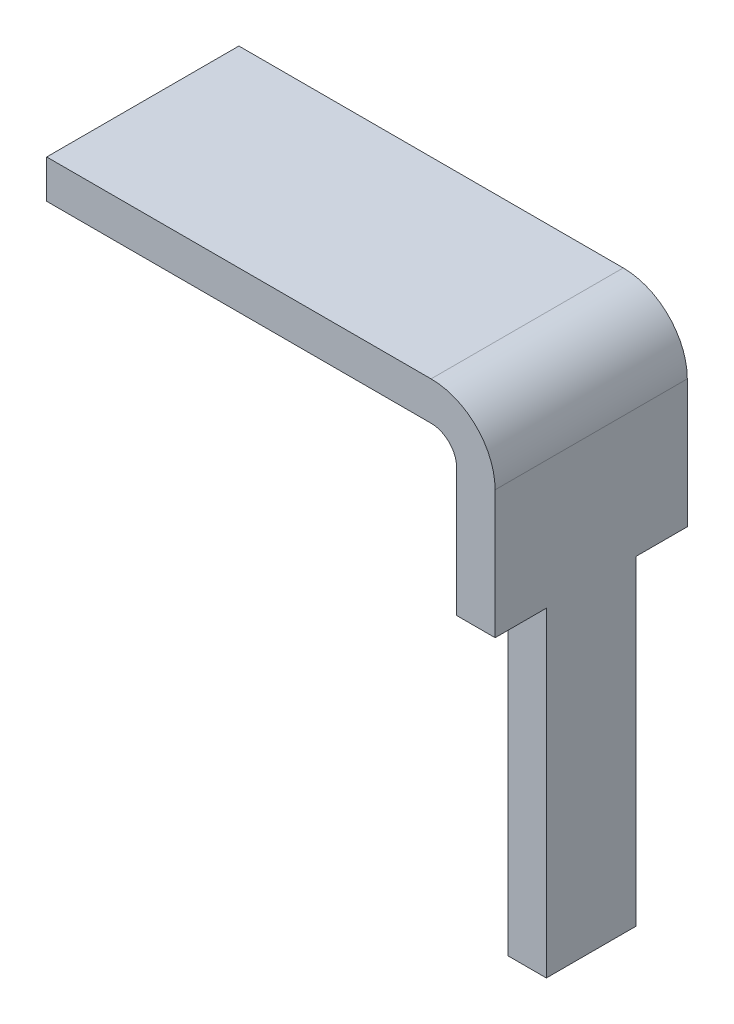
ISO-10303-21;
HEADER;
FILE_DESCRIPTION(('STEP AP214'),'2;1');
FILE_NAME('part.step','',(''),(''),'','','');
FILE_SCHEMA(('AUTOMOTIVE_DESIGN { 1 0 10303 214 1 1 1 1 }'));
ENDSEC;
DATA;
#1=APPLICATION_CONTEXT('core data for automotive mechanical design processes');
#2=APPLICATION_PROTOCOL_DEFINITION('international standard','automotive_design',2000,#1);
#3=PRODUCT_CONTEXT('',#1,'mechanical');
#4=PRODUCT('Part','Part','',(#3));
#5=PRODUCT_RELATED_PRODUCT_CATEGORY('part','',(#4));
#6=PRODUCT_DEFINITION_FORMATION('','',#4);
#7=PRODUCT_DEFINITION_CONTEXT('part definition',#1,'design');
#8=PRODUCT_DEFINITION('design','',#6,#7);
#9=PRODUCT_DEFINITION_SHAPE('','',#8);
#10=(LENGTH_UNIT() NAMED_UNIT(*) SI_UNIT(.MILLI.,.METRE.));
#11=(NAMED_UNIT(*) PLANE_ANGLE_UNIT() SI_UNIT($,.RADIAN.));
#12=(NAMED_UNIT(*) SI_UNIT($,.STERADIAN.) SOLID_ANGLE_UNIT());
#13=UNCERTAINTY_MEASURE_WITH_UNIT(LENGTH_MEASURE(1.E-05),#10,'distance_accuracy_value','');
#14=(GEOMETRIC_REPRESENTATION_CONTEXT(3) GLOBAL_UNCERTAINTY_ASSIGNED_CONTEXT((#13)) GLOBAL_UNIT_ASSIGNED_CONTEXT((#10,
#11,#12)) REPRESENTATION_CONTEXT('',''));
#15=CARTESIAN_POINT('',(0.,0.,0.));
#16=DIRECTION('',(0.,0.,1.));
#17=DIRECTION('',(1.,0.,0.));
#18=AXIS2_PLACEMENT_3D('',#15,#16,#17);
#19=CARTESIAN_POINT('',(0.,0.,1.5));
#20=DIRECTION('',(1.,0.,0.));
#21=DIRECTION('',(0.,0.,-1.));
#22=AXIS2_PLACEMENT_3D('',#19,#20,#21);
#23=PLANE('',#22);
#24=DIRECTION('',(0.,-1.,0.));
#25=VECTOR('',#24,1.);
#26=CARTESIAN_POINT('',(0.,0.,0.));
#27=LINE('',#26,#25);
#28=CARTESIAN_POINT('',(0.,0.,0.));
#29=VERTEX_POINT('',#28);
#30=CARTESIAN_POINT('',(0.,-0.3,0.));
#31=VERTEX_POINT('',#30);
#32=EDGE_CURVE('E210',#29,#31,#27,.T.);
#33=ORIENTED_EDGE('',*,*,#32,.T.);
#34=DIRECTION('',(0.,0.,-1.));
#35=VECTOR('',#34,1.);
#36=CARTESIAN_POINT('',(0.,-0.3,1.5));
#37=LINE('',#36,#35);
#38=CARTESIAN_POINT('',(0.,-0.3,1.5));
#39=VERTEX_POINT('',#38);
#40=EDGE_CURVE('E170',#39,#31,#37,.T.);
#41=ORIENTED_EDGE('',*,*,#40,.F.);
#42=DIRECTION('',(0.,-1.,0.));
#43=VECTOR('',#42,1.);
#44=CARTESIAN_POINT('',(0.,0.,1.5));
#45=LINE('',#44,#43);
#46=CARTESIAN_POINT('',(0.,0.,1.5));
#47=VERTEX_POINT('',#46);
#48=EDGE_CURVE('E196',#47,#39,#45,.T.);
#49=ORIENTED_EDGE('',*,*,#48,.F.);
#50=DIRECTION('',(0.,0.,-1.));
#51=VECTOR('',#50,1.);
#52=CARTESIAN_POINT('',(0.,0.,1.5));
#53=LINE('',#52,#51);
#54=EDGE_CURVE('E197',#47,#29,#53,.T.);
#55=ORIENTED_EDGE('',*,*,#54,.T.);
#56=EDGE_LOOP('',(#33,#41,#49,#55));
#57=FACE_BOUND('',#56,.T.);
#58=ADVANCED_FACE('F43',(#57),#23,.F.);
#59=CARTESIAN_POINT('',(0.,-0.3,1.5));
#60=DIRECTION('',(0.,1.,0.));
#61=DIRECTION('',(0.,0.,1.));
#62=AXIS2_PLACEMENT_3D('',#59,#60,#61);
#63=PLANE('',#62);
#64=DIRECTION('',(1.,0.,0.));
#65=VECTOR('',#64,1.);
#66=CARTESIAN_POINT('',(0.,-0.3,0.));
#67=LINE('',#66,#65);
#68=CARTESIAN_POINT('',(3.,-0.3,0.));
#69=VERTEX_POINT('',#68);
#70=EDGE_CURVE('E212',#31,#69,#67,.T.);
#71=ORIENTED_EDGE('',*,*,#70,.T.);
#72=DIRECTION('',(0.,0.,-1.));
#73=VECTOR('',#72,1.);
#74=CARTESIAN_POINT('',(3.,-0.3,1.5));
#75=LINE('',#74,#73);
#76=CARTESIAN_POINT('',(3.,-0.3,1.5));
#77=VERTEX_POINT('',#76);
#78=EDGE_CURVE('E167',#77,#69,#75,.T.);
#79=ORIENTED_EDGE('',*,*,#78,.F.);
#80=DIRECTION('',(1.,0.,0.));
#81=VECTOR('',#80,1.);
#82=CARTESIAN_POINT('',(0.,-0.3,1.5));
#83=LINE('',#82,#81);
#84=EDGE_CURVE('E239',#39,#77,#83,.T.);
#85=ORIENTED_EDGE('',*,*,#84,.F.);
#86=ORIENTED_EDGE('',*,*,#40,.T.);
#87=EDGE_LOOP('',(#71,#79,#85,#86));
#88=FACE_BOUND('',#87,.T.);
#89=ADVANCED_FACE('F269',(#88),#63,.F.);
#90=CARTESIAN_POINT('',(3.,-0.5,1.5));
#91=DIRECTION('',(0.,0.,-1.));
#92=DIRECTION('',(-1.,0.,0.));
#93=AXIS2_PLACEMENT_3D('',#90,#91,#92);
#94=CYLINDRICAL_SURFACE('',#93,0.2);
#95=CARTESIAN_POINT('',(3.,-0.5,0.));
#96=DIRECTION('',(0.,0.,-1.));
#97=DIRECTION('',(-1.,0.,0.));
#98=AXIS2_PLACEMENT_3D('',#95,#96,#97);
#99=CIRCLE('',#98,0.2);
#100=CARTESIAN_POINT('',(3.2,-0.5,0.));
#101=VERTEX_POINT('',#100);
#102=EDGE_CURVE('E191',#69,#101,#99,.T.);
#103=ORIENTED_EDGE('',*,*,#102,.T.);
#104=DIRECTION('',(0.,0.,-1.));
#105=VECTOR('',#104,1.);
#106=CARTESIAN_POINT('',(3.2,-0.5,1.5));
#107=LINE('',#106,#105);
#108=CARTESIAN_POINT('',(3.2,-0.5,1.5));
#109=VERTEX_POINT('',#108);
#110=EDGE_CURVE('E158',#109,#101,#107,.T.);
#111=ORIENTED_EDGE('',*,*,#110,.F.);
#112=CARTESIAN_POINT('',(3.,-0.5,1.5));
#113=DIRECTION('',(0.,0.,-1.));
#114=DIRECTION('',(-1.,0.,0.));
#115=AXIS2_PLACEMENT_3D('',#112,#113,#114);
#116=CIRCLE('',#115,0.2);
#117=EDGE_CURVE('E235',#77,#109,#116,.T.);
#118=ORIENTED_EDGE('',*,*,#117,.F.);
#119=ORIENTED_EDGE('',*,*,#78,.T.);
#120=EDGE_LOOP('',(#103,#111,#118,#119));
#121=FACE_BOUND('',#120,.T.);
#122=ADVANCED_FACE('F223',(#121),#94,.F.);
#123=CARTESIAN_POINT('',(3.2,-0.5,1.5));
#124=DIRECTION('',(1.,0.,0.));
#125=DIRECTION('',(0.,1.,0.));
#126=AXIS2_PLACEMENT_3D('',#123,#124,#125);
#127=PLANE('',#126);
#128=DIRECTION('',(0.,1.,0.));
#129=VECTOR('',#128,1.);
#130=CARTESIAN_POINT('',(3.2,-0.5,1.1));
#131=LINE('',#130,#129);
#132=CARTESIAN_POINT('',(3.2,-4.,1.1));
#133=VERTEX_POINT('',#132);
#134=CARTESIAN_POINT('',(3.2,-1.5,1.1));
#135=VERTEX_POINT('',#134);
#136=EDGE_CURVE('E137',#133,#135,#131,.T.);
#137=ORIENTED_EDGE('',*,*,#136,.T.);
#138=DIRECTION('',(0.,0.,1.));
#139=VECTOR('',#138,1.);
#140=CARTESIAN_POINT('',(3.2,-1.5,1.5));
#141=LINE('',#140,#139);
#142=CARTESIAN_POINT('',(3.2,-1.5,1.5));
#143=VERTEX_POINT('',#142);
#144=EDGE_CURVE('E232',#135,#143,#141,.T.);
#145=ORIENTED_EDGE('',*,*,#144,.T.);
#146=DIRECTION('',(0.,-1.,0.));
#147=VECTOR('',#146,1.);
#148=CARTESIAN_POINT('',(3.2,-0.5,1.5));
#149=LINE('',#148,#147);
#150=EDGE_CURVE('E231',#109,#143,#149,.T.);
#151=ORIENTED_EDGE('',*,*,#150,.F.);
#152=ORIENTED_EDGE('',*,*,#110,.T.);
#153=DIRECTION('',(0.,-1.,0.));
#154=VECTOR('',#153,1.);
#155=CARTESIAN_POINT('',(3.2,-0.5,0.));
#156=LINE('',#155,#154);
#157=CARTESIAN_POINT('',(3.2,-1.5,0.));
#158=VERTEX_POINT('',#157);
#159=EDGE_CURVE('E187',#101,#158,#156,.T.);
#160=ORIENTED_EDGE('',*,*,#159,.T.);
#161=DIRECTION('',(0.,0.,1.));
#162=VECTOR('',#161,1.);
#163=CARTESIAN_POINT('',(3.2,-1.5,1.5));
#164=LINE('',#163,#162);
#165=CARTESIAN_POINT('',(3.2,-1.5,0.4));
#166=VERTEX_POINT('',#165);
#167=EDGE_CURVE('E64',#158,#166,#164,.T.);
#168=ORIENTED_EDGE('',*,*,#167,.T.);
#169=DIRECTION('',(0.,-1.,0.));
#170=VECTOR('',#169,1.);
#171=CARTESIAN_POINT('',(3.2,-0.5,0.4));
#172=LINE('',#171,#170);
#173=CARTESIAN_POINT('',(3.2,-4.,0.4));
#174=VERTEX_POINT('',#173);
#175=EDGE_CURVE('E217',#166,#174,#172,.T.);
#176=ORIENTED_EDGE('',*,*,#175,.T.);
#177=DIRECTION('',(0.,0.,-1.));
#178=VECTOR('',#177,1.);
#179=CARTESIAN_POINT('',(3.2,-4.,1.5));
#180=LINE('',#179,#178);
#181=EDGE_CURVE('E155',#133,#174,#180,.T.);
#182=ORIENTED_EDGE('',*,*,#181,.F.);
#183=EDGE_LOOP('',(#137,#145,#151,#152,#160,#168,#176,#182));
#184=FACE_BOUND('',#183,.T.);
#185=ADVANCED_FACE('F228',(#184),#127,.F.);
#186=CARTESIAN_POINT('',(3.2,-4.,1.5));
#187=DIRECTION('',(0.,1.,0.));
#188=DIRECTION('',(0.,0.,1.));
#189=AXIS2_PLACEMENT_3D('',#186,#187,#188);
#190=PLANE('',#189);
#191=DIRECTION('',(0.,0.,-1.));
#192=VECTOR('',#191,1.);
#193=CARTESIAN_POINT('',(3.5,-4.,1.5));
#194=LINE('',#193,#192);
#195=CARTESIAN_POINT('',(3.5,-4.,1.1));
#196=VERTEX_POINT('',#195);
#197=CARTESIAN_POINT('',(3.5,-4.,0.4));
#198=VERTEX_POINT('',#197);
#199=EDGE_CURVE('E149',#196,#198,#194,.T.);
#200=ORIENTED_EDGE('',*,*,#199,.F.);
#201=DIRECTION('',(1.,0.,0.));
#202=VECTOR('',#201,1.);
#203=CARTESIAN_POINT('',(2.,-4.,1.1));
#204=LINE('',#203,#202);
#205=EDGE_CURVE('E131',#133,#196,#204,.T.);
#206=ORIENTED_EDGE('',*,*,#205,.F.);
#207=ORIENTED_EDGE('',*,*,#181,.T.);
#208=DIRECTION('',(1.,0.,0.));
#209=VECTOR('',#208,1.);
#210=CARTESIAN_POINT('',(2.,-4.,0.4));
#211=LINE('',#210,#209);
#212=EDGE_CURVE('E154',#174,#198,#211,.T.);
#213=ORIENTED_EDGE('',*,*,#212,.T.);
#214=EDGE_LOOP('',(#200,#206,#207,#213));
#215=FACE_BOUND('',#214,.T.);
#216=ADVANCED_FACE('F153',(#215),#190,.F.);
#217=CARTESIAN_POINT('',(3.5,-0.5,1.5));
#218=DIRECTION('',(-1.,0.,0.));
#219=DIRECTION('',(0.,-1.,0.));
#220=AXIS2_PLACEMENT_3D('',#217,#218,#219);
#221=PLANE('',#220);
#222=DIRECTION('',(0.,1.,0.));
#223=VECTOR('',#222,1.);
#224=CARTESIAN_POINT('',(3.5,-0.5,1.5));
#225=LINE('',#224,#223);
#226=CARTESIAN_POINT('',(3.5,-1.5,1.5));
#227=VERTEX_POINT('',#226);
#228=CARTESIAN_POINT('',(3.5,-0.5,1.5));
#229=VERTEX_POINT('',#228);
#230=EDGE_CURVE('E234',#227,#229,#225,.T.);
#231=ORIENTED_EDGE('',*,*,#230,.F.);
#232=DIRECTION('',(0.,0.,1.));
#233=VECTOR('',#232,1.);
#234=CARTESIAN_POINT('',(3.5,-1.5,1.5));
#235=LINE('',#234,#233);
#236=CARTESIAN_POINT('',(3.5,-1.5,1.1));
#237=VERTEX_POINT('',#236);
#238=EDGE_CURVE('E57',#237,#227,#235,.T.);
#239=ORIENTED_EDGE('',*,*,#238,.F.);
#240=DIRECTION('',(0.,1.,0.));
#241=VECTOR('',#240,1.);
#242=CARTESIAN_POINT('',(3.5,-1.5,1.1));
#243=LINE('',#242,#241);
#244=EDGE_CURVE('E135',#196,#237,#243,.T.);
#245=ORIENTED_EDGE('',*,*,#244,.F.);
#246=ORIENTED_EDGE('',*,*,#199,.T.);
#247=DIRECTION('',(0.,-1.,0.));
#248=VECTOR('',#247,1.);
#249=CARTESIAN_POINT('',(3.5,-1.5,0.4));
#250=LINE('',#249,#248);
#251=CARTESIAN_POINT('',(3.5,-1.5,0.4));
#252=VERTEX_POINT('',#251);
#253=EDGE_CURVE('E181',#252,#198,#250,.T.);
#254=ORIENTED_EDGE('',*,*,#253,.F.);
#255=DIRECTION('',(0.,0.,1.));
#256=VECTOR('',#255,1.);
#257=CARTESIAN_POINT('',(3.5,-1.5,0.));
#258=LINE('',#257,#256);
#259=CARTESIAN_POINT('',(3.5,-1.5,0.));
#260=VERTEX_POINT('',#259);
#261=EDGE_CURVE('E150',#260,#252,#258,.T.);
#262=ORIENTED_EDGE('',*,*,#261,.F.);
#263=DIRECTION('',(0.,1.,0.));
#264=VECTOR('',#263,1.);
#265=CARTESIAN_POINT('',(3.5,-0.5,0.));
#266=LINE('',#265,#264);
#267=CARTESIAN_POINT('',(3.5,-0.5,0.));
#268=VERTEX_POINT('',#267);
#269=EDGE_CURVE('E180',#260,#268,#266,.T.);
#270=ORIENTED_EDGE('',*,*,#269,.T.);
#271=DIRECTION('',(0.,0.,-1.));
#272=VECTOR('',#271,1.);
#273=CARTESIAN_POINT('',(3.5,-0.5,1.5));
#274=LINE('',#273,#272);
#275=EDGE_CURVE('E156',#229,#268,#274,.T.);
#276=ORIENTED_EDGE('',*,*,#275,.F.);
#277=EDGE_LOOP('',(#231,#239,#245,#246,#254,#262,#270,#276));
#278=FACE_BOUND('',#277,.T.);
#279=ADVANCED_FACE('F147',(#278),#221,.F.);
#280=CARTESIAN_POINT('',(3.,-0.5,1.5));
#281=DIRECTION('',(0.,0.,-1.));
#282=DIRECTION('',(-1.,0.,0.));
#283=AXIS2_PLACEMENT_3D('',#280,#281,#282);
#284=CYLINDRICAL_SURFACE('',#283,0.5);
#285=CARTESIAN_POINT('',(3.,-0.5,0.));
#286=DIRECTION('',(0.,0.,1.));
#287=DIRECTION('',(-1.,0.,0.));
#288=AXIS2_PLACEMENT_3D('',#285,#286,#287);
#289=CIRCLE('',#288,0.5);
#290=CARTESIAN_POINT('',(3.,0.,0.));
#291=VERTEX_POINT('',#290);
#292=EDGE_CURVE('E186',#268,#291,#289,.T.);
#293=ORIENTED_EDGE('',*,*,#292,.T.);
#294=DIRECTION('',(0.,0.,-1.));
#295=VECTOR('',#294,1.);
#296=CARTESIAN_POINT('',(3.,0.,1.5));
#297=LINE('',#296,#295);
#298=CARTESIAN_POINT('',(3.,0.,1.5));
#299=VERTEX_POINT('',#298);
#300=EDGE_CURVE('E161',#299,#291,#297,.T.);
#301=ORIENTED_EDGE('',*,*,#300,.F.);
#302=CARTESIAN_POINT('',(3.,-0.5,1.5));
#303=DIRECTION('',(0.,0.,1.));
#304=DIRECTION('',(-1.,0.,0.));
#305=AXIS2_PLACEMENT_3D('',#302,#303,#304);
#306=CIRCLE('',#305,0.5);
#307=EDGE_CURVE('E237',#229,#299,#306,.T.);
#308=ORIENTED_EDGE('',*,*,#307,.F.);
#309=ORIENTED_EDGE('',*,*,#275,.T.);
#310=EDGE_LOOP('',(#293,#301,#308,#309));
#311=FACE_BOUND('',#310,.T.);
#312=ADVANCED_FACE('F285',(#311),#284,.T.);
#313=CARTESIAN_POINT('',(0.,0.,1.5));
#314=DIRECTION('',(0.,-1.,0.));
#315=DIRECTION('',(0.,0.,-1.));
#316=AXIS2_PLACEMENT_3D('',#313,#314,#315);
#317=PLANE('',#316);
#318=DIRECTION('',(-1.,0.,0.));
#319=VECTOR('',#318,1.);
#320=CARTESIAN_POINT('',(0.,0.,0.));
#321=LINE('',#320,#319);
#322=EDGE_CURVE('E189',#291,#29,#321,.T.);
#323=ORIENTED_EDGE('',*,*,#322,.T.);
#324=ORIENTED_EDGE('',*,*,#54,.F.);
#325=DIRECTION('',(-1.,0.,0.));
#326=VECTOR('',#325,1.);
#327=CARTESIAN_POINT('',(0.,0.,1.5));
#328=LINE('',#327,#326);
#329=EDGE_CURVE('E199',#299,#47,#328,.T.);
#330=ORIENTED_EDGE('',*,*,#329,.F.);
#331=ORIENTED_EDGE('',*,*,#300,.T.);
#332=EDGE_LOOP('',(#323,#324,#330,#331));
#333=FACE_BOUND('',#332,.T.);
#334=ADVANCED_FACE('F204',(#333),#317,.F.);
#335=CARTESIAN_POINT('',(3.,-0.5,1.5));
#336=DIRECTION('',(0.,0.,-1.));
#337=DIRECTION('',(-1.,0.,0.));
#338=AXIS2_PLACEMENT_3D('',#335,#336,#337);
#339=PLANE('',#338);
#340=ORIENTED_EDGE('',*,*,#150,.T.);
#341=DIRECTION('',(1.,0.,0.));
#342=VECTOR('',#341,1.);
#343=CARTESIAN_POINT('',(3.,-1.5,1.5));
#344=LINE('',#343,#342);
#345=EDGE_CURVE('E11',#143,#227,#344,.T.);
#346=ORIENTED_EDGE('',*,*,#345,.T.);
#347=ORIENTED_EDGE('',*,*,#230,.T.);
#348=ORIENTED_EDGE('',*,*,#307,.T.);
#349=ORIENTED_EDGE('',*,*,#329,.T.);
#350=ORIENTED_EDGE('',*,*,#48,.T.);
#351=ORIENTED_EDGE('',*,*,#84,.T.);
#352=ORIENTED_EDGE('',*,*,#117,.T.);
#353=EDGE_LOOP('',(#340,#346,#347,#348,#349,#350,#351,#352));
#354=FACE_BOUND('',#353,.T.);
#355=ADVANCED_FACE('F243',(#354),#339,.F.);
#356=CARTESIAN_POINT('',(3.,-0.5,0.));
#357=DIRECTION('',(0.,0.,-1.));
#358=DIRECTION('',(-1.,0.,0.));
#359=AXIS2_PLACEMENT_3D('',#356,#357,#358);
#360=PLANE('',#359);
#361=DIRECTION('',(1.,0.,0.));
#362=VECTOR('',#361,1.);
#363=CARTESIAN_POINT('',(3.,-1.5,0.));
#364=LINE('',#363,#362);
#365=EDGE_CURVE('E50',#158,#260,#364,.T.);
#366=ORIENTED_EDGE('',*,*,#365,.F.);
#367=ORIENTED_EDGE('',*,*,#159,.F.);
#368=ORIENTED_EDGE('',*,*,#102,.F.);
#369=ORIENTED_EDGE('',*,*,#70,.F.);
#370=ORIENTED_EDGE('',*,*,#32,.F.);
#371=ORIENTED_EDGE('',*,*,#322,.F.);
#372=ORIENTED_EDGE('',*,*,#292,.F.);
#373=ORIENTED_EDGE('',*,*,#269,.F.);
#374=EDGE_LOOP('',(#366,#367,#368,#369,#370,#371,#372,#373));
#375=FACE_BOUND('',#374,.T.);
#376=ADVANCED_FACE('F184',(#375),#360,.T.);
#377=CARTESIAN_POINT('',(2.,-1.5,0.4));
#378=DIRECTION('',(0.,0.,1.));
#379=DIRECTION('',(0.,-1.,0.));
#380=AXIS2_PLACEMENT_3D('',#377,#378,#379);
#381=PLANE('',#380);
#382=DIRECTION('',(1.,0.,0.));
#383=VECTOR('',#382,1.);
#384=CARTESIAN_POINT('',(2.,-1.5,0.4));
#385=LINE('',#384,#383);
#386=EDGE_CURVE('E252',#166,#252,#385,.T.);
#387=ORIENTED_EDGE('',*,*,#386,.T.);
#388=ORIENTED_EDGE('',*,*,#253,.T.);
#389=ORIENTED_EDGE('',*,*,#212,.F.);
#390=ORIENTED_EDGE('',*,*,#175,.F.);
#391=EDGE_LOOP('',(#387,#388,#389,#390));
#392=FACE_BOUND('',#391,.T.);
#393=ADVANCED_FACE('F258',(#392),#381,.F.);
#394=CARTESIAN_POINT('',(2.,-1.5,0.));
#395=DIRECTION('',(0.,1.,0.));
#396=DIRECTION('',(-1.,0.,0.));
#397=AXIS2_PLACEMENT_3D('',#394,#395,#396);
#398=PLANE('',#397);
#399=ORIENTED_EDGE('',*,*,#365,.T.);
#400=ORIENTED_EDGE('',*,*,#261,.T.);
#401=ORIENTED_EDGE('',*,*,#386,.F.);
#402=ORIENTED_EDGE('',*,*,#167,.F.);
#403=EDGE_LOOP('',(#399,#400,#401,#402));
#404=FACE_BOUND('',#403,.T.);
#405=ADVANCED_FACE('F174',(#404),#398,.F.);
#406=CARTESIAN_POINT('',(2.,-1.5,1.1));
#407=DIRECTION('',(0.,0.,-1.));
#408=DIRECTION('',(0.,1.,0.));
#409=AXIS2_PLACEMENT_3D('',#406,#407,#408);
#410=PLANE('',#409);
#411=ORIENTED_EDGE('',*,*,#205,.T.);
#412=ORIENTED_EDGE('',*,*,#244,.T.);
#413=DIRECTION('',(1.,0.,0.));
#414=VECTOR('',#413,1.);
#415=CARTESIAN_POINT('',(2.,-1.5,1.1));
#416=LINE('',#415,#414);
#417=EDGE_CURVE('E142',#135,#237,#416,.T.);
#418=ORIENTED_EDGE('',*,*,#417,.F.);
#419=ORIENTED_EDGE('',*,*,#136,.F.);
#420=EDGE_LOOP('',(#411,#412,#418,#419));
#421=FACE_BOUND('',#420,.T.);
#422=ADVANCED_FACE('F133',(#421),#410,.F.);
#423=CARTESIAN_POINT('',(2.,-1.5,1.5));
#424=DIRECTION('',(0.,1.,0.));
#425=DIRECTION('',(-1.,0.,0.));
#426=AXIS2_PLACEMENT_3D('',#423,#424,#425);
#427=PLANE('',#426);
#428=ORIENTED_EDGE('',*,*,#417,.T.);
#429=ORIENTED_EDGE('',*,*,#238,.T.);
#430=ORIENTED_EDGE('',*,*,#345,.F.);
#431=ORIENTED_EDGE('',*,*,#144,.F.);
#432=EDGE_LOOP('',(#428,#429,#430,#431));
#433=FACE_BOUND('',#432,.T.);
#434=ADVANCED_FACE('F256',(#433),#427,.F.);
#435=CLOSED_SHELL('',(#58,#89,#122,#185,#216,#279,#312,#334,#355,#376,#393,#405,#422,#434));
#436=MANIFOLD_SOLID_BREP('B2',#435);
#437=ADVANCED_BREP_SHAPE_REPRESENTATION('',(#18,#436),#14);
#438=SHAPE_DEFINITION_REPRESENTATION(#9,#437);
ENDSEC;
END-ISO-10303-21;
